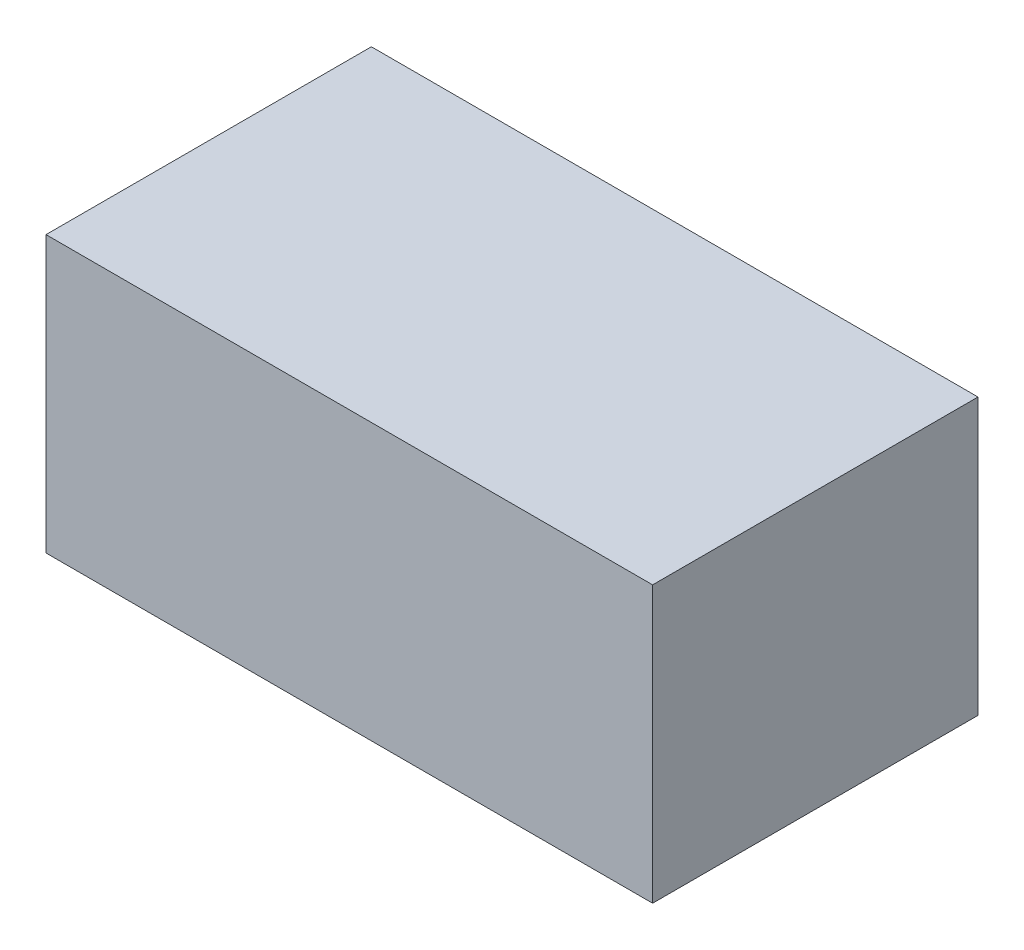
ISO-10303-21;
HEADER;
FILE_DESCRIPTION(('STEP AP214'),'2;1');
FILE_NAME('part.step','',(''),(''),'','','');
FILE_SCHEMA(('AUTOMOTIVE_DESIGN { 1 0 10303 214 1 1 1 1 }'));
ENDSEC;
DATA;
#1=APPLICATION_CONTEXT('core data for automotive mechanical design processes');
#2=APPLICATION_PROTOCOL_DEFINITION('international standard','automotive_design',2000,#1);
#3=PRODUCT_CONTEXT('',#1,'mechanical');
#4=PRODUCT('Part','Part','',(#3));
#5=PRODUCT_RELATED_PRODUCT_CATEGORY('part','',(#4));
#6=PRODUCT_DEFINITION_FORMATION('','',#4);
#7=PRODUCT_DEFINITION_CONTEXT('part definition',#1,'design');
#8=PRODUCT_DEFINITION('design','',#6,#7);
#9=PRODUCT_DEFINITION_SHAPE('','',#8);
#10=(LENGTH_UNIT() NAMED_UNIT(*) SI_UNIT(.MILLI.,.METRE.));
#11=(NAMED_UNIT(*) PLANE_ANGLE_UNIT() SI_UNIT($,.RADIAN.));
#12=(NAMED_UNIT(*) SI_UNIT($,.STERADIAN.) SOLID_ANGLE_UNIT());
#13=UNCERTAINTY_MEASURE_WITH_UNIT(LENGTH_MEASURE(1.E-05),#10,'distance_accuracy_value','');
#14=(GEOMETRIC_REPRESENTATION_CONTEXT(3) GLOBAL_UNCERTAINTY_ASSIGNED_CONTEXT((#13)) GLOBAL_UNIT_ASSIGNED_CONTEXT((#10,
#11,#12)) REPRESENTATION_CONTEXT('',''));
#15=CARTESIAN_POINT('',(0.,0.,0.));
#16=DIRECTION('',(0.,0.,1.));
#17=DIRECTION('',(1.,0.,0.));
#18=AXIS2_PLACEMENT_3D('',#15,#16,#17);
#19=CARTESIAN_POINT('',(139.7,-63.5,149.86));
#20=DIRECTION('',(-1.,0.,0.));
#21=DIRECTION('',(0.,0.,1.));
#22=AXIS2_PLACEMENT_3D('',#19,#20,#21);
#23=PLANE('',#22);
#24=DIRECTION('',(0.,1.,0.));
#25=VECTOR('',#24,1.);
#26=CARTESIAN_POINT('',(139.7,-63.5,0.));
#27=LINE('',#26,#25);
#28=CARTESIAN_POINT('',(139.7,-63.5,0.));
#29=VERTEX_POINT('',#28);
#30=CARTESIAN_POINT('',(139.7,63.5,0.));
#31=VERTEX_POINT('',#30);
#32=EDGE_CURVE('E93',#29,#31,#27,.T.);
#33=ORIENTED_EDGE('',*,*,#32,.T.);
#34=DIRECTION('',(0.,0.,-1.));
#35=VECTOR('',#34,1.);
#36=CARTESIAN_POINT('',(139.7,63.5,149.86));
#37=LINE('',#36,#35);
#38=CARTESIAN_POINT('',(139.7,63.5,149.86));
#39=VERTEX_POINT('',#38);
#40=EDGE_CURVE('E11',#39,#31,#37,.T.);
#41=ORIENTED_EDGE('',*,*,#40,.F.);
#42=DIRECTION('',(0.,1.,0.));
#43=VECTOR('',#42,1.);
#44=CARTESIAN_POINT('',(139.7,-63.5,149.86));
#45=LINE('',#44,#43);
#46=CARTESIAN_POINT('',(139.7,-63.5,149.86));
#47=VERTEX_POINT('',#46);
#48=EDGE_CURVE('E81',#47,#39,#45,.T.);
#49=ORIENTED_EDGE('',*,*,#48,.F.);
#50=DIRECTION('',(0.,0.,-1.));
#51=VECTOR('',#50,1.);
#52=CARTESIAN_POINT('',(139.7,-63.5,149.86));
#53=LINE('',#52,#51);
#54=EDGE_CURVE('E89',#47,#29,#53,.T.);
#55=ORIENTED_EDGE('',*,*,#54,.T.);
#56=EDGE_LOOP('',(#33,#41,#49,#55));
#57=FACE_BOUND('',#56,.T.);
#58=ADVANCED_FACE('F30',(#57),#23,.F.);
#59=CARTESIAN_POINT('',(-139.7,63.5,149.86));
#60=DIRECTION('',(0.,-1.,0.));
#61=DIRECTION('',(0.,0.,-1.));
#62=AXIS2_PLACEMENT_3D('',#59,#60,#61);
#63=PLANE('',#62);
#64=DIRECTION('',(-1.,0.,0.));
#65=VECTOR('',#64,1.);
#66=CARTESIAN_POINT('',(-139.7,63.5,0.));
#67=LINE('',#66,#65);
#68=CARTESIAN_POINT('',(-139.7,63.5,0.));
#69=VERTEX_POINT('',#68);
#70=EDGE_CURVE('E85',#31,#69,#67,.T.);
#71=ORIENTED_EDGE('',*,*,#70,.T.);
#72=DIRECTION('',(0.,0.,-1.));
#73=VECTOR('',#72,1.);
#74=CARTESIAN_POINT('',(-139.7,63.5,149.86));
#75=LINE('',#74,#73);
#76=CARTESIAN_POINT('',(-139.7,63.5,149.86));
#77=VERTEX_POINT('',#76);
#78=EDGE_CURVE('E38',#77,#69,#75,.T.);
#79=ORIENTED_EDGE('',*,*,#78,.F.);
#80=DIRECTION('',(-1.,0.,0.));
#81=VECTOR('',#80,1.);
#82=CARTESIAN_POINT('',(-139.7,63.5,149.86));
#83=LINE('',#82,#81);
#84=EDGE_CURVE('E76',#39,#77,#83,.T.);
#85=ORIENTED_EDGE('',*,*,#84,.F.);
#86=ORIENTED_EDGE('',*,*,#40,.T.);
#87=EDGE_LOOP('',(#71,#79,#85,#86));
#88=FACE_BOUND('',#87,.T.);
#89=ADVANCED_FACE('F84',(#88),#63,.F.);
#90=CARTESIAN_POINT('',(-139.7,-63.5,149.86));
#91=DIRECTION('',(1.,0.,0.));
#92=DIRECTION('',(0.,0.,-1.));
#93=AXIS2_PLACEMENT_3D('',#90,#91,#92);
#94=PLANE('',#93);
#95=DIRECTION('',(0.,-1.,0.));
#96=VECTOR('',#95,1.);
#97=CARTESIAN_POINT('',(-139.7,-63.5,0.));
#98=LINE('',#97,#96);
#99=CARTESIAN_POINT('',(-139.7,-63.5,0.));
#100=VERTEX_POINT('',#99);
#101=EDGE_CURVE('E63',#69,#100,#98,.T.);
#102=ORIENTED_EDGE('',*,*,#101,.T.);
#103=DIRECTION('',(0.,0.,-1.));
#104=VECTOR('',#103,1.);
#105=CARTESIAN_POINT('',(-139.7,-63.5,149.86));
#106=LINE('',#105,#104);
#107=CARTESIAN_POINT('',(-139.7,-63.5,149.86));
#108=VERTEX_POINT('',#107);
#109=EDGE_CURVE('E86',#108,#100,#106,.T.);
#110=ORIENTED_EDGE('',*,*,#109,.F.);
#111=DIRECTION('',(0.,-1.,0.));
#112=VECTOR('',#111,1.);
#113=CARTESIAN_POINT('',(-139.7,-63.5,149.86));
#114=LINE('',#113,#112);
#115=EDGE_CURVE('E79',#77,#108,#114,.T.);
#116=ORIENTED_EDGE('',*,*,#115,.F.);
#117=ORIENTED_EDGE('',*,*,#78,.T.);
#118=EDGE_LOOP('',(#102,#110,#116,#117));
#119=FACE_BOUND('',#118,.T.);
#120=ADVANCED_FACE('F87',(#119),#94,.F.);
#121=CARTESIAN_POINT('',(-139.7,-63.5,149.86));
#122=DIRECTION('',(0.,1.,0.));
#123=DIRECTION('',(0.,0.,1.));
#124=AXIS2_PLACEMENT_3D('',#121,#122,#123);
#125=PLANE('',#124);
#126=DIRECTION('',(1.,0.,0.));
#127=VECTOR('',#126,1.);
#128=CARTESIAN_POINT('',(-139.7,-63.5,0.));
#129=LINE('',#128,#127);
#130=EDGE_CURVE('E69',#100,#29,#129,.T.);
#131=ORIENTED_EDGE('',*,*,#130,.T.);
#132=ORIENTED_EDGE('',*,*,#54,.F.);
#133=DIRECTION('',(1.,0.,0.));
#134=VECTOR('',#133,1.);
#135=CARTESIAN_POINT('',(-139.7,-63.5,149.86));
#136=LINE('',#135,#134);
#137=EDGE_CURVE('E46',#108,#47,#136,.T.);
#138=ORIENTED_EDGE('',*,*,#137,.F.);
#139=ORIENTED_EDGE('',*,*,#109,.T.);
#140=EDGE_LOOP('',(#131,#132,#138,#139));
#141=FACE_BOUND('',#140,.T.);
#142=ADVANCED_FACE('F100',(#141),#125,.F.);
#143=CARTESIAN_POINT('',(139.7,63.5,149.86));
#144=DIRECTION('',(0.,0.,-1.));
#145=DIRECTION('',(-1.,0.,0.));
#146=AXIS2_PLACEMENT_3D('',#143,#144,#145);
#147=PLANE('',#146);
#148=ORIENTED_EDGE('',*,*,#48,.T.);
#149=ORIENTED_EDGE('',*,*,#84,.T.);
#150=ORIENTED_EDGE('',*,*,#115,.T.);
#151=ORIENTED_EDGE('',*,*,#137,.T.);
#152=EDGE_LOOP('',(#148,#149,#150,#151));
#153=FACE_BOUND('',#152,.T.);
#154=ADVANCED_FACE('F77',(#153),#147,.F.);
#155=CARTESIAN_POINT('',(139.7,63.5,0.));
#156=DIRECTION('',(0.,0.,-1.));
#157=DIRECTION('',(-1.,0.,0.));
#158=AXIS2_PLACEMENT_3D('',#155,#156,#157);
#159=PLANE('',#158);
#160=ORIENTED_EDGE('',*,*,#32,.F.);
#161=ORIENTED_EDGE('',*,*,#130,.F.);
#162=ORIENTED_EDGE('',*,*,#101,.F.);
#163=ORIENTED_EDGE('',*,*,#70,.F.);
#164=EDGE_LOOP('',(#160,#161,#162,#163));
#165=FACE_BOUND('',#164,.T.);
#166=ADVANCED_FACE('F103',(#165),#159,.T.);
#167=CLOSED_SHELL('',(#58,#89,#120,#142,#154,#166));
#168=MANIFOLD_SOLID_BREP('B2',#167);
#169=ADVANCED_BREP_SHAPE_REPRESENTATION('',(#18,#168),#14);
#170=SHAPE_DEFINITION_REPRESENTATION(#9,#169);
ENDSEC;
END-ISO-10303-21;
